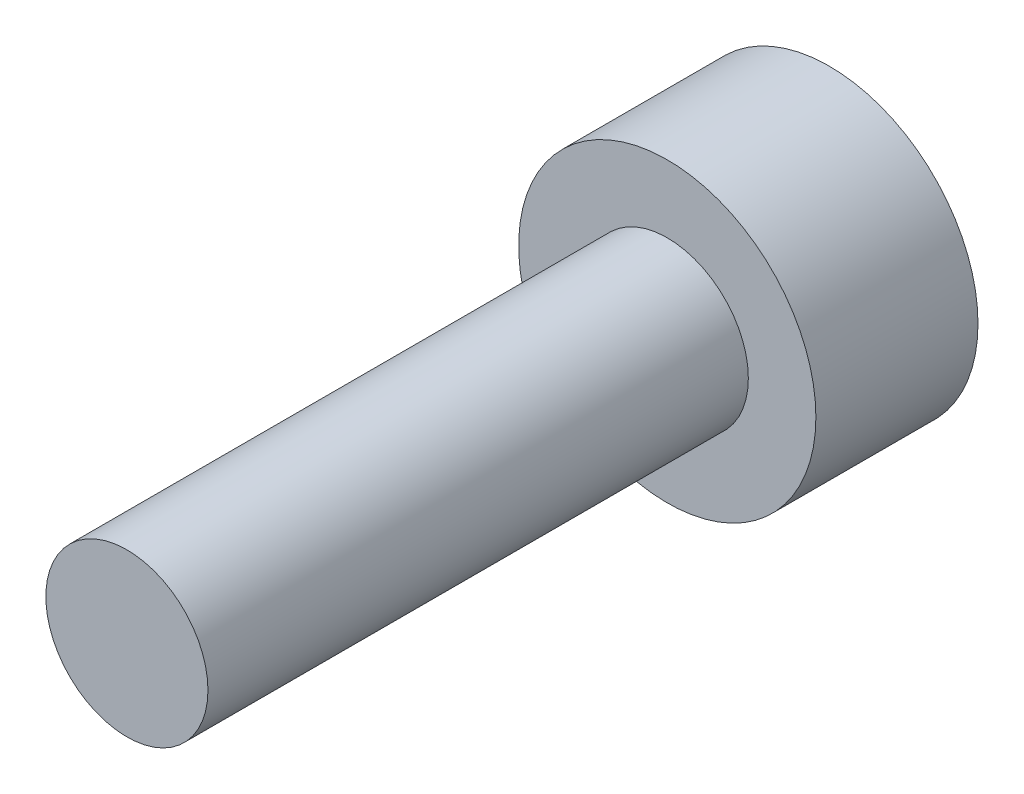
ISO-10303-21;
HEADER;
FILE_DESCRIPTION(('STEP AP214'),'2;1');
FILE_NAME('part.step','',(''),(''),'','','');
FILE_SCHEMA(('AUTOMOTIVE_DESIGN { 1 0 10303 214 1 1 1 1 }'));
ENDSEC;
DATA;
#1=APPLICATION_CONTEXT('core data for automotive mechanical design processes');
#2=APPLICATION_PROTOCOL_DEFINITION('international standard','automotive_design',2000,#1);
#3=PRODUCT_CONTEXT('',#1,'mechanical');
#4=PRODUCT('Part','Part','',(#3));
#5=PRODUCT_RELATED_PRODUCT_CATEGORY('part','',(#4));
#6=PRODUCT_DEFINITION_FORMATION('','',#4);
#7=PRODUCT_DEFINITION_CONTEXT('part definition',#1,'design');
#8=PRODUCT_DEFINITION('design','',#6,#7);
#9=PRODUCT_DEFINITION_SHAPE('','',#8);
#10=(LENGTH_UNIT() NAMED_UNIT(*) SI_UNIT(.MILLI.,.METRE.));
#11=(NAMED_UNIT(*) PLANE_ANGLE_UNIT() SI_UNIT($,.RADIAN.));
#12=(NAMED_UNIT(*) SI_UNIT($,.STERADIAN.) SOLID_ANGLE_UNIT());
#13=UNCERTAINTY_MEASURE_WITH_UNIT(LENGTH_MEASURE(1.E-05),#10,'distance_accuracy_value','');
#14=(GEOMETRIC_REPRESENTATION_CONTEXT(3) GLOBAL_UNCERTAINTY_ASSIGNED_CONTEXT((#13)) GLOBAL_UNIT_ASSIGNED_CONTEXT((#10,
#11,#12)) REPRESENTATION_CONTEXT('',''));
#15=CARTESIAN_POINT('',(0.,0.,0.));
#16=DIRECTION('',(0.,0.,1.));
#17=DIRECTION('',(1.,0.,0.));
#18=AXIS2_PLACEMENT_3D('',#15,#16,#17);
#19=CARTESIAN_POINT('',(0.,0.,0.));
#20=DIRECTION('',(0.,0.,-1.));
#21=DIRECTION('',(-1.,0.,0.));
#22=AXIS2_PLACEMENT_3D('',#19,#20,#21);
#23=PLANE('',#22);
#24=DIRECTION('',(-0.5,0.866025403784439,0.));
#25=VECTOR('',#24,1.);
#26=CARTESIAN_POINT('',(-0.866025403784439,-1.5,0.));
#27=LINE('',#26,#25);
#28=CARTESIAN_POINT('',(-0.866025403784439,-1.5,0.));
#29=VERTEX_POINT('',#28);
#30=CARTESIAN_POINT('',(-1.73205080756888,0.,0.));
#31=VERTEX_POINT('',#30);
#32=EDGE_CURVE('E47',#29,#31,#27,.T.);
#33=ORIENTED_EDGE('',*,*,#32,.F.);
#34=DIRECTION('',(-1.,0.,0.));
#35=VECTOR('',#34,1.);
#36=CARTESIAN_POINT('',(0.866025403784438,-1.5,0.));
#37=LINE('',#36,#35);
#38=CARTESIAN_POINT('',(0.866025403784438,-1.5,0.));
#39=VERTEX_POINT('',#38);
#40=EDGE_CURVE('E130',#39,#29,#37,.T.);
#41=ORIENTED_EDGE('',*,*,#40,.F.);
#42=DIRECTION('',(-0.5,-0.866025403784439,0.));
#43=VECTOR('',#42,1.);
#44=CARTESIAN_POINT('',(1.73205080756888,0.,0.));
#45=LINE('',#44,#43);
#46=CARTESIAN_POINT('',(1.73205080756888,0.,0.));
#47=VERTEX_POINT('',#46);
#48=EDGE_CURVE('E128',#47,#39,#45,.T.);
#49=ORIENTED_EDGE('',*,*,#48,.F.);
#50=DIRECTION('',(0.5,-0.866025403784439,0.));
#51=VECTOR('',#50,1.);
#52=CARTESIAN_POINT('',(0.866025403784439,1.5,0.));
#53=LINE('',#52,#51);
#54=CARTESIAN_POINT('',(0.866025403784439,1.5,0.));
#55=VERTEX_POINT('',#54);
#56=EDGE_CURVE('E95',#55,#47,#53,.T.);
#57=ORIENTED_EDGE('',*,*,#56,.F.);
#58=DIRECTION('',(1.,0.,0.));
#59=VECTOR('',#58,1.);
#60=CARTESIAN_POINT('',(-0.866025403784438,1.5,0.));
#61=LINE('',#60,#59);
#62=CARTESIAN_POINT('',(-0.866025403784438,1.5,0.));
#63=VERTEX_POINT('',#62);
#64=EDGE_CURVE('E124',#63,#55,#61,.T.);
#65=ORIENTED_EDGE('',*,*,#64,.F.);
#66=DIRECTION('',(0.5,0.866025403784438,0.));
#67=VECTOR('',#66,1.);
#68=CARTESIAN_POINT('',(-1.73205080756888,0.,0.));
#69=LINE('',#68,#67);
#70=EDGE_CURVE('E121',#31,#63,#69,.T.);
#71=ORIENTED_EDGE('',*,*,#70,.F.);
#72=EDGE_LOOP('',(#33,#41,#49,#57,#65,#71));
#73=FACE_BOUND('',#72,.T.);
#74=CARTESIAN_POINT('',(0.,0.,0.));
#75=DIRECTION('',(0.,0.,1.));
#76=DIRECTION('',(1.,0.,0.));
#77=AXIS2_PLACEMENT_3D('',#74,#75,#76);
#78=CIRCLE('',#77,2.75);
#79=CARTESIAN_POINT('',(2.75,0.,0.));
#80=VERTEX_POINT('',#79);
#81=EDGE_CURVE('E11',#80,#80,#78,.T.);
#82=ORIENTED_EDGE('',*,*,#81,.F.);
#83=EDGE_LOOP('',(#82));
#84=FACE_BOUND('',#83,.T.);
#85=ADVANCED_FACE('F33',(#73,#84),#23,.T.);
#86=CARTESIAN_POINT('',(0.,0.,3.));
#87=DIRECTION('',(0.,0.,1.));
#88=DIRECTION('',(1.,0.,0.));
#89=AXIS2_PLACEMENT_3D('',#86,#87,#88);
#90=CYLINDRICAL_SURFACE('',#89,2.75);
#91=ORIENTED_EDGE('',*,*,#81,.T.);
#92=EDGE_LOOP('',(#91));
#93=FACE_BOUND('',#92,.T.);
#94=CARTESIAN_POINT('',(0.,0.,3.));
#95=DIRECTION('',(0.,0.,1.));
#96=DIRECTION('',(1.,0.,0.));
#97=AXIS2_PLACEMENT_3D('',#94,#95,#96);
#98=CIRCLE('',#97,2.75);
#99=CARTESIAN_POINT('',(2.75,0.,3.));
#100=VERTEX_POINT('',#99);
#101=EDGE_CURVE('E40',#100,#100,#98,.T.);
#102=ORIENTED_EDGE('',*,*,#101,.F.);
#103=EDGE_LOOP('',(#102));
#104=FACE_BOUND('',#103,.T.);
#105=ADVANCED_FACE('F150',(#93,#104),#90,.T.);
#106=CARTESIAN_POINT('',(2.75,0.,3.));
#107=DIRECTION('',(0.,0.,1.));
#108=DIRECTION('',(1.,0.,0.));
#109=AXIS2_PLACEMENT_3D('',#106,#107,#108);
#110=PLANE('',#109);
#111=ORIENTED_EDGE('',*,*,#101,.T.);
#112=EDGE_LOOP('',(#111));
#113=FACE_BOUND('',#112,.T.);
#114=CARTESIAN_POINT('',(0.,0.,3.));
#115=DIRECTION('',(0.,0.,1.));
#116=DIRECTION('',(1.,0.,0.));
#117=AXIS2_PLACEMENT_3D('',#114,#115,#116);
#118=CIRCLE('',#117,1.5);
#119=CARTESIAN_POINT('',(1.5,0.,3.));
#120=VERTEX_POINT('',#119);
#121=EDGE_CURVE('E142',#120,#120,#118,.T.);
#122=ORIENTED_EDGE('',*,*,#121,.F.);
#123=EDGE_LOOP('',(#122));
#124=FACE_BOUND('',#123,.T.);
#125=ADVANCED_FACE('F147',(#113,#124),#110,.T.);
#126=CARTESIAN_POINT('',(0.,0.,3.));
#127=DIRECTION('',(0.,0.,1.));
#128=DIRECTION('',(1.,0.,0.));
#129=AXIS2_PLACEMENT_3D('',#126,#127,#128);
#130=CYLINDRICAL_SURFACE('',#129,1.5);
#131=ORIENTED_EDGE('',*,*,#121,.T.);
#132=EDGE_LOOP('',(#131));
#133=FACE_BOUND('',#132,.T.);
#134=CARTESIAN_POINT('',(0.,0.,13.));
#135=DIRECTION('',(0.,0.,1.));
#136=DIRECTION('',(1.,0.,0.));
#137=AXIS2_PLACEMENT_3D('',#134,#135,#136);
#138=CIRCLE('',#137,1.5);
#139=CARTESIAN_POINT('',(1.5,0.,13.));
#140=VERTEX_POINT('',#139);
#141=EDGE_CURVE('E134',#140,#140,#138,.T.);
#142=ORIENTED_EDGE('',*,*,#141,.F.);
#143=EDGE_LOOP('',(#142));
#144=FACE_BOUND('',#143,.T.);
#145=ADVANCED_FACE('F157',(#133,#144),#130,.T.);
#146=CARTESIAN_POINT('',(1.5,0.,13.));
#147=DIRECTION('',(0.,0.,1.));
#148=DIRECTION('',(1.,0.,0.));
#149=AXIS2_PLACEMENT_3D('',#146,#147,#148);
#150=PLANE('',#149);
#151=ORIENTED_EDGE('',*,*,#141,.T.);
#152=EDGE_LOOP('',(#151));
#153=FACE_BOUND('',#152,.T.);
#154=ADVANCED_FACE('F163',(#153),#150,.T.);
#155=CARTESIAN_POINT('',(-0.866025403784439,-1.5,1.5));
#156=DIRECTION('',(-0.866025403784439,-0.5,0.));
#157=DIRECTION('',(0.5,-0.866025403784439,0.));
#158=AXIS2_PLACEMENT_3D('',#155,#156,#157);
#159=PLANE('',#158);
#160=ORIENTED_EDGE('',*,*,#32,.T.);
#161=DIRECTION('',(0.,0.,-1.));
#162=VECTOR('',#161,1.);
#163=CARTESIAN_POINT('',(-1.73205080756888,0.,1.5));
#164=LINE('',#163,#162);
#165=CARTESIAN_POINT('',(-1.73205080756888,0.,1.5));
#166=VERTEX_POINT('',#165);
#167=EDGE_CURVE('E77',#166,#31,#164,.T.);
#168=ORIENTED_EDGE('',*,*,#167,.F.);
#169=DIRECTION('',(-0.5,0.866025403784439,0.));
#170=VECTOR('',#169,1.);
#171=CARTESIAN_POINT('',(-0.866025403784439,-1.5,1.5));
#172=LINE('',#171,#170);
#173=CARTESIAN_POINT('',(-0.866025403784439,-1.5,1.5));
#174=VERTEX_POINT('',#173);
#175=EDGE_CURVE('E132',#174,#166,#172,.T.);
#176=ORIENTED_EDGE('',*,*,#175,.F.);
#177=DIRECTION('',(0.,0.,-1.));
#178=VECTOR('',#177,1.);
#179=CARTESIAN_POINT('',(-0.866025403784439,-1.5,1.5));
#180=LINE('',#179,#178);
#181=EDGE_CURVE('E55',#174,#29,#180,.T.);
#182=ORIENTED_EDGE('',*,*,#181,.T.);
#183=EDGE_LOOP('',(#160,#168,#176,#182));
#184=FACE_BOUND('',#183,.T.);
#185=ADVANCED_FACE('F167',(#184),#159,.F.);
#186=CARTESIAN_POINT('',(0.866025403784438,-1.5,1.5));
#187=DIRECTION('',(0.,-1.,0.));
#188=DIRECTION('',(1.,0.,0.));
#189=AXIS2_PLACEMENT_3D('',#186,#187,#188);
#190=PLANE('',#189);
#191=ORIENTED_EDGE('',*,*,#40,.T.);
#192=ORIENTED_EDGE('',*,*,#181,.F.);
#193=DIRECTION('',(-1.,0.,0.));
#194=VECTOR('',#193,1.);
#195=CARTESIAN_POINT('',(0.866025403784438,-1.5,1.5));
#196=LINE('',#195,#194);
#197=CARTESIAN_POINT('',(0.866025403784438,-1.5,1.5));
#198=VERTEX_POINT('',#197);
#199=EDGE_CURVE('E107',#198,#174,#196,.T.);
#200=ORIENTED_EDGE('',*,*,#199,.F.);
#201=DIRECTION('',(0.,0.,-1.));
#202=VECTOR('',#201,1.);
#203=CARTESIAN_POINT('',(0.866025403784438,-1.5,1.5));
#204=LINE('',#203,#202);
#205=EDGE_CURVE('E99',#198,#39,#204,.T.);
#206=ORIENTED_EDGE('',*,*,#205,.T.);
#207=EDGE_LOOP('',(#191,#192,#200,#206));
#208=FACE_BOUND('',#207,.T.);
#209=ADVANCED_FACE('F171',(#208),#190,.F.);
#210=CARTESIAN_POINT('',(1.73205080756888,0.,1.5));
#211=DIRECTION('',(0.866025403784438,-0.5,0.));
#212=DIRECTION('',(0.5,0.866025403784439,0.));
#213=AXIS2_PLACEMENT_3D('',#210,#211,#212);
#214=PLANE('',#213);
#215=ORIENTED_EDGE('',*,*,#48,.T.);
#216=ORIENTED_EDGE('',*,*,#205,.F.);
#217=DIRECTION('',(-0.5,-0.866025403784439,0.));
#218=VECTOR('',#217,1.);
#219=CARTESIAN_POINT('',(1.73205080756888,0.,1.5));
#220=LINE('',#219,#218);
#221=CARTESIAN_POINT('',(1.73205080756888,0.,1.5));
#222=VERTEX_POINT('',#221);
#223=EDGE_CURVE('E103',#222,#198,#220,.T.);
#224=ORIENTED_EDGE('',*,*,#223,.F.);
#225=DIRECTION('',(0.,0.,-1.));
#226=VECTOR('',#225,1.);
#227=CARTESIAN_POINT('',(1.73205080756888,0.,1.5));
#228=LINE('',#227,#226);
#229=EDGE_CURVE('E88',#222,#47,#228,.T.);
#230=ORIENTED_EDGE('',*,*,#229,.T.);
#231=EDGE_LOOP('',(#215,#216,#224,#230));
#232=FACE_BOUND('',#231,.T.);
#233=ADVANCED_FACE('F104',(#232),#214,.F.);
#234=CARTESIAN_POINT('',(0.866025403784439,1.5,1.5));
#235=DIRECTION('',(0.866025403784439,0.5,0.));
#236=DIRECTION('',(-0.5,0.866025403784439,0.));
#237=AXIS2_PLACEMENT_3D('',#234,#235,#236);
#238=PLANE('',#237);
#239=ORIENTED_EDGE('',*,*,#56,.T.);
#240=ORIENTED_EDGE('',*,*,#229,.F.);
#241=DIRECTION('',(0.5,-0.866025403784439,0.));
#242=VECTOR('',#241,1.);
#243=CARTESIAN_POINT('',(0.866025403784439,1.5,1.5));
#244=LINE('',#243,#242);
#245=CARTESIAN_POINT('',(0.866025403784439,1.5,1.5));
#246=VERTEX_POINT('',#245);
#247=EDGE_CURVE('E92',#246,#222,#244,.T.);
#248=ORIENTED_EDGE('',*,*,#247,.F.);
#249=DIRECTION('',(0.,0.,-1.));
#250=VECTOR('',#249,1.);
#251=CARTESIAN_POINT('',(0.866025403784439,1.5,1.5));
#252=LINE('',#251,#250);
#253=EDGE_CURVE('E100',#246,#55,#252,.T.);
#254=ORIENTED_EDGE('',*,*,#253,.T.);
#255=EDGE_LOOP('',(#239,#240,#248,#254));
#256=FACE_BOUND('',#255,.T.);
#257=ADVANCED_FACE('F90',(#256),#238,.F.);
#258=CARTESIAN_POINT('',(-0.866025403784438,1.5,1.5));
#259=DIRECTION('',(0.,1.,0.));
#260=DIRECTION('',(-1.,0.,0.));
#261=AXIS2_PLACEMENT_3D('',#258,#259,#260);
#262=PLANE('',#261);
#263=ORIENTED_EDGE('',*,*,#64,.T.);
#264=ORIENTED_EDGE('',*,*,#253,.F.);
#265=DIRECTION('',(1.,0.,0.));
#266=VECTOR('',#265,1.);
#267=CARTESIAN_POINT('',(-0.866025403784438,1.5,1.5));
#268=LINE('',#267,#266);
#269=CARTESIAN_POINT('',(-0.866025403784438,1.5,1.5));
#270=VERTEX_POINT('',#269);
#271=EDGE_CURVE('E113',#270,#246,#268,.T.);
#272=ORIENTED_EDGE('',*,*,#271,.F.);
#273=DIRECTION('',(0.,0.,-1.));
#274=VECTOR('',#273,1.);
#275=CARTESIAN_POINT('',(-0.866025403784438,1.5,1.5));
#276=LINE('',#275,#274);
#277=EDGE_CURVE('E137',#270,#63,#276,.T.);
#278=ORIENTED_EDGE('',*,*,#277,.T.);
#279=EDGE_LOOP('',(#263,#264,#272,#278));
#280=FACE_BOUND('',#279,.T.);
#281=ADVANCED_FACE('F175',(#280),#262,.F.);
#282=CARTESIAN_POINT('',(-1.73205080756888,0.,1.5));
#283=DIRECTION('',(-0.866025403784439,0.5,0.));
#284=DIRECTION('',(-0.5,-0.866025403784439,0.));
#285=AXIS2_PLACEMENT_3D('',#282,#283,#284);
#286=PLANE('',#285);
#287=ORIENTED_EDGE('',*,*,#70,.T.);
#288=ORIENTED_EDGE('',*,*,#277,.F.);
#289=DIRECTION('',(0.5,0.866025403784438,0.));
#290=VECTOR('',#289,1.);
#291=CARTESIAN_POINT('',(-1.73205080756888,0.,1.5));
#292=LINE('',#291,#290);
#293=EDGE_CURVE('E115',#166,#270,#292,.T.);
#294=ORIENTED_EDGE('',*,*,#293,.F.);
#295=ORIENTED_EDGE('',*,*,#167,.T.);
#296=EDGE_LOOP('',(#287,#288,#294,#295));
#297=FACE_BOUND('',#296,.T.);
#298=ADVANCED_FACE('F172',(#297),#286,.F.);
#299=CARTESIAN_POINT('',(0.,0.,1.5));
#300=DIRECTION('',(0.,0.,-1.));
#301=DIRECTION('',(-1.,0.,0.));
#302=AXIS2_PLACEMENT_3D('',#299,#300,#301);
#303=PLANE('',#302);
#304=ORIENTED_EDGE('',*,*,#175,.T.);
#305=ORIENTED_EDGE('',*,*,#293,.T.);
#306=ORIENTED_EDGE('',*,*,#271,.T.);
#307=ORIENTED_EDGE('',*,*,#247,.T.);
#308=ORIENTED_EDGE('',*,*,#223,.T.);
#309=ORIENTED_EDGE('',*,*,#199,.T.);
#310=EDGE_LOOP('',(#304,#305,#306,#307,#308,#309));
#311=FACE_BOUND('',#310,.T.);
#312=ADVANCED_FACE('F110',(#311),#303,.T.);
#313=CLOSED_SHELL('',(#85,#105,#125,#145,#154,#185,#209,#233,#257,#281,#298,#312));
#314=MANIFOLD_SOLID_BREP('B2',#313);
#315=ADVANCED_BREP_SHAPE_REPRESENTATION('',(#18,#314),#14);
#316=SHAPE_DEFINITION_REPRESENTATION(#9,#315);
ENDSEC;
END-ISO-10303-21;
